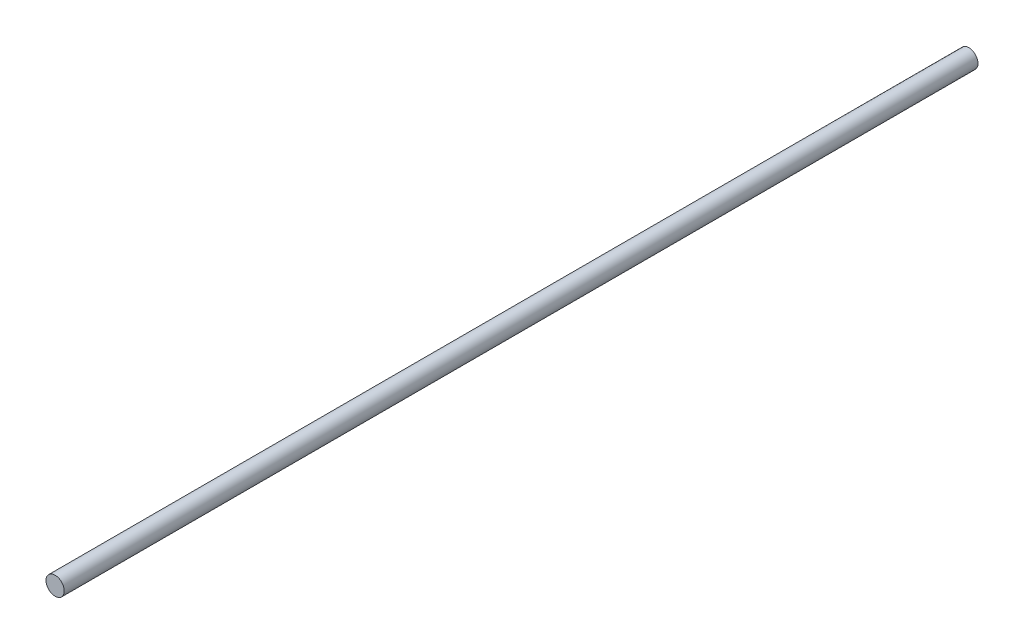
ISO-10303-21;
HEADER;
FILE_DESCRIPTION(('STEP AP214'),'2;1');
FILE_NAME('part.step','',(''),(''),'','','');
FILE_SCHEMA(('AUTOMOTIVE_DESIGN { 1 0 10303 214 1 1 1 1 }'));
ENDSEC;
DATA;
#1=APPLICATION_CONTEXT('core data for automotive mechanical design processes');
#2=APPLICATION_PROTOCOL_DEFINITION('international standard','automotive_design',2000,#1);
#3=PRODUCT_CONTEXT('',#1,'mechanical');
#4=PRODUCT('Part','Part','',(#3));
#5=PRODUCT_RELATED_PRODUCT_CATEGORY('part','',(#4));
#6=PRODUCT_DEFINITION_FORMATION('','',#4);
#7=PRODUCT_DEFINITION_CONTEXT('part definition',#1,'design');
#8=PRODUCT_DEFINITION('design','',#6,#7);
#9=PRODUCT_DEFINITION_SHAPE('','',#8);
#10=(LENGTH_UNIT() NAMED_UNIT(*) SI_UNIT(.MILLI.,.METRE.));
#11=(NAMED_UNIT(*) PLANE_ANGLE_UNIT() SI_UNIT($,.RADIAN.));
#12=(NAMED_UNIT(*) SI_UNIT($,.STERADIAN.) SOLID_ANGLE_UNIT());
#13=UNCERTAINTY_MEASURE_WITH_UNIT(LENGTH_MEASURE(1.E-05),#10,'distance_accuracy_value','');
#14=(GEOMETRIC_REPRESENTATION_CONTEXT(3) GLOBAL_UNCERTAINTY_ASSIGNED_CONTEXT((#13)) GLOBAL_UNIT_ASSIGNED_CONTEXT((#10,
#11,#12)) REPRESENTATION_CONTEXT('',''));
#15=CARTESIAN_POINT('',(0.,0.,0.));
#16=DIRECTION('',(0.,0.,1.));
#17=DIRECTION('',(1.,0.,0.));
#18=AXIS2_PLACEMENT_3D('',#15,#16,#17);
#19=CARTESIAN_POINT('',(0.,0.,100.));
#20=DIRECTION('',(0.,0.,-1.));
#21=DIRECTION('',(-1.,0.,0.));
#22=AXIS2_PLACEMENT_3D('',#19,#20,#21);
#23=CYLINDRICAL_SURFACE('',#22,1.);
#24=CARTESIAN_POINT('',(0.,0.,100.));
#25=DIRECTION('',(0.,0.,1.));
#26=DIRECTION('',(1.,0.,0.));
#27=AXIS2_PLACEMENT_3D('',#24,#25,#26);
#28=CIRCLE('',#27,1.);
#29=CARTESIAN_POINT('',(1.,0.,100.));
#30=VERTEX_POINT('',#29);
#31=EDGE_CURVE('E10',#30,#30,#28,.T.);
#32=ORIENTED_EDGE('',*,*,#31,.F.);
#33=EDGE_LOOP('',(#32));
#34=FACE_BOUND('',#33,.T.);
#35=CARTESIAN_POINT('',(0.,0.,0.));
#36=DIRECTION('',(0.,0.,1.));
#37=DIRECTION('',(1.,0.,0.));
#38=AXIS2_PLACEMENT_3D('',#35,#36,#37);
#39=CIRCLE('',#38,1.);
#40=CARTESIAN_POINT('',(1.,0.,0.));
#41=VERTEX_POINT('',#40);
#42=EDGE_CURVE('E34',#41,#41,#39,.T.);
#43=ORIENTED_EDGE('',*,*,#42,.T.);
#44=EDGE_LOOP('',(#43));
#45=FACE_BOUND('',#44,.T.);
#46=ADVANCED_FACE('F31',(#34,#45),#23,.T.);
#47=CARTESIAN_POINT('',(0.,0.,100.));
#48=DIRECTION('',(0.,0.,1.));
#49=DIRECTION('',(1.,0.,0.));
#50=AXIS2_PLACEMENT_3D('',#47,#48,#49);
#51=PLANE('',#50);
#52=ORIENTED_EDGE('',*,*,#31,.T.);
#53=EDGE_LOOP('',(#52));
#54=FACE_BOUND('',#53,.T.);
#55=ADVANCED_FACE('F46',(#54),#51,.T.);
#56=CARTESIAN_POINT('',(0.,0.,0.));
#57=DIRECTION('',(0.,0.,1.));
#58=DIRECTION('',(1.,0.,0.));
#59=AXIS2_PLACEMENT_3D('',#56,#57,#58);
#60=PLANE('',#59);
#61=ORIENTED_EDGE('',*,*,#42,.F.);
#62=EDGE_LOOP('',(#61));
#63=FACE_BOUND('',#62,.T.);
#64=ADVANCED_FACE('F44',(#63),#60,.F.);
#65=CLOSED_SHELL('',(#46,#55,#64));
#66=MANIFOLD_SOLID_BREP('B2',#65);
#67=ADVANCED_BREP_SHAPE_REPRESENTATION('',(#18,#66),#14);
#68=SHAPE_DEFINITION_REPRESENTATION(#9,#67);
ENDSEC;
END-ISO-10303-21;
